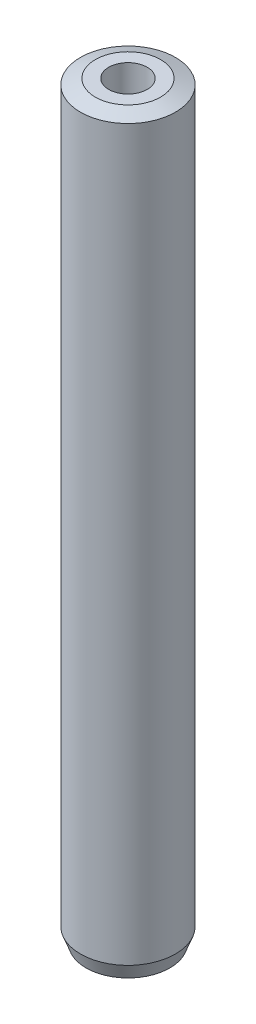
ISO-10303-21;
HEADER;
FILE_DESCRIPTION(('STEP AP214'),'2;1');
FILE_NAME('part.step','',(''),(''),'','','');
FILE_SCHEMA(('AUTOMOTIVE_DESIGN { 1 0 10303 214 1 1 1 1 }'));
ENDSEC;
DATA;
#1=APPLICATION_CONTEXT('core data for automotive mechanical design processes');
#2=APPLICATION_PROTOCOL_DEFINITION('international standard','automotive_design',2000,#1);
#3=PRODUCT_CONTEXT('',#1,'mechanical');
#4=PRODUCT('Part','Part','',(#3));
#5=PRODUCT_RELATED_PRODUCT_CATEGORY('part','',(#4));
#6=PRODUCT_DEFINITION_FORMATION('','',#4);
#7=PRODUCT_DEFINITION_CONTEXT('part definition',#1,'design');
#8=PRODUCT_DEFINITION('design','',#6,#7);
#9=PRODUCT_DEFINITION_SHAPE('','',#8);
#10=(LENGTH_UNIT() NAMED_UNIT(*) SI_UNIT(.MILLI.,.METRE.));
#11=(NAMED_UNIT(*) PLANE_ANGLE_UNIT() SI_UNIT($,.RADIAN.));
#12=(NAMED_UNIT(*) SI_UNIT($,.STERADIAN.) SOLID_ANGLE_UNIT());
#13=UNCERTAINTY_MEASURE_WITH_UNIT(LENGTH_MEASURE(1.E-05),#10,'distance_accuracy_value','');
#14=(GEOMETRIC_REPRESENTATION_CONTEXT(3) GLOBAL_UNCERTAINTY_ASSIGNED_CONTEXT((#13)) GLOBAL_UNIT_ASSIGNED_CONTEXT((#10,
#11,#12)) REPRESENTATION_CONTEXT('',''));
#15=CARTESIAN_POINT('',(0.,0.,0.));
#16=DIRECTION('',(0.,0.,1.));
#17=DIRECTION('',(1.,0.,0.));
#18=AXIS2_PLACEMENT_3D('',#15,#16,#17);
#19=CARTESIAN_POINT('',(0.,197.237292432304,0.));
#20=DIRECTION('',(0.,-1.,0.));
#21=DIRECTION('',(0.,0.,-1.));
#22=AXIS2_PLACEMENT_3D('',#19,#20,#21);
#23=CYLINDRICAL_SURFACE('',#22,12.5);
#24=CARTESIAN_POINT('',(0.,195.769966645253,0.));
#25=DIRECTION('',(0.,1.,0.));
#26=DIRECTION('',(0.,0.,1.));
#27=AXIS2_PLACEMENT_3D('',#24,#25,#26);
#28=CIRCLE('',#27,12.5);
#29=CARTESIAN_POINT('',(0.,195.769966645253,12.5));
#30=VERTEX_POINT('',#29);
#31=EDGE_CURVE('E50',#30,#30,#28,.F.);
#32=ORIENTED_EDGE('',*,*,#31,.T.);
#33=EDGE_LOOP('',(#32));
#34=FACE_BOUND('',#33,.T.);
#35=CARTESIAN_POINT('',(0.,3.92238217395144,0.));
#36=DIRECTION('',(0.,1.,0.));
#37=DIRECTION('',(0.,0.,1.));
#38=AXIS2_PLACEMENT_3D('',#35,#36,#37);
#39=CIRCLE('',#38,12.5);
#40=CARTESIAN_POINT('',(0.,3.92238217395144,12.5));
#41=VERTEX_POINT('',#40);
#42=EDGE_CURVE('E51',#41,#41,#39,.T.);
#43=ORIENTED_EDGE('',*,*,#42,.T.);
#44=EDGE_LOOP('',(#43));
#45=FACE_BOUND('',#44,.T.);
#46=ADVANCED_FACE('F39',(#34,#45),#23,.T.);
#47=CARTESIAN_POINT('',(0.,197.237292432304,0.));
#48=DIRECTION('',(0.,1.,0.));
#49=DIRECTION('',(0.,0.,1.));
#50=AXIS2_PLACEMENT_3D('',#47,#48,#49);
#51=PLANE('',#50);
#52=CARTESIAN_POINT('',(0.,197.237292432304,0.));
#53=DIRECTION('',(0.,1.,0.));
#54=DIRECTION('',(0.,0.,1.));
#55=AXIS2_PLACEMENT_3D('',#52,#53,#54);
#56=CIRCLE('',#55,8.57761782604866);
#57=CARTESIAN_POINT('',(0.,197.237292432304,8.57761782604866));
#58=VERTEX_POINT('',#57);
#59=EDGE_CURVE('E54',#58,#58,#56,.T.);
#60=ORIENTED_EDGE('',*,*,#59,.T.);
#61=EDGE_LOOP('',(#60));
#62=FACE_BOUND('',#61,.T.);
#63=CARTESIAN_POINT('',(0.,197.237292432304,0.));
#64=DIRECTION('',(0.,1.,0.));
#65=DIRECTION('',(0.,0.,1.));
#66=AXIS2_PLACEMENT_3D('',#63,#64,#65);
#67=CIRCLE('',#66,5.06899430948886);
#68=CARTESIAN_POINT('',(0.,197.237292432304,5.06899430948886));
#69=VERTEX_POINT('',#68);
#70=EDGE_CURVE('E58',#69,#69,#67,.T.);
#71=ORIENTED_EDGE('',*,*,#70,.F.);
#72=EDGE_LOOP('',(#71));
#73=FACE_BOUND('',#72,.T.);
#74=ADVANCED_FACE('F69',(#62,#73),#51,.T.);
#75=CARTESIAN_POINT('',(0.,0.,0.));
#76=DIRECTION('',(0.,1.,0.));
#77=DIRECTION('',(0.,0.,1.));
#78=AXIS2_PLACEMENT_3D('',#75,#76,#77);
#79=PLANE('',#78);
#80=CARTESIAN_POINT('',(0.,0.,0.));
#81=DIRECTION('',(0.,1.,0.));
#82=DIRECTION('',(0.,0.,1.));
#83=AXIS2_PLACEMENT_3D('',#80,#81,#82);
#84=CIRCLE('',#83,11.0326742129485);
#85=CARTESIAN_POINT('',(0.,0.,11.0326742129485));
#86=VERTEX_POINT('',#85);
#87=EDGE_CURVE('E10',#86,#86,#84,.F.);
#88=ORIENTED_EDGE('',*,*,#87,.T.);
#89=EDGE_LOOP('',(#88));
#90=FACE_BOUND('',#89,.T.);
#91=CARTESIAN_POINT('',(0.,0.,0.));
#92=DIRECTION('',(0.,1.,0.));
#93=DIRECTION('',(0.,0.,1.));
#94=AXIS2_PLACEMENT_3D('',#91,#92,#93);
#95=CIRCLE('',#94,5.06899430948886);
#96=CARTESIAN_POINT('',(0.,0.,5.06899430948886));
#97=VERTEX_POINT('',#96);
#98=EDGE_CURVE('E63',#97,#97,#95,.T.);
#99=ORIENTED_EDGE('',*,*,#98,.T.);
#100=EDGE_LOOP('',(#99));
#101=FACE_BOUND('',#100,.T.);
#102=ADVANCED_FACE('F75',(#90,#101),#79,.F.);
#103=CARTESIAN_POINT('',(0.,197.237292432304,0.));
#104=DIRECTION('',(0.,-1.,0.));
#105=DIRECTION('',(0.,0.,-1.));
#106=AXIS2_PLACEMENT_3D('',#103,#104,#105);
#107=CYLINDRICAL_SURFACE('',#106,5.06899430948886);
#108=ORIENTED_EDGE('',*,*,#70,.T.);
#109=EDGE_LOOP('',(#108));
#110=FACE_BOUND('',#109,.T.);
#111=ORIENTED_EDGE('',*,*,#98,.F.);
#112=EDGE_LOOP('',(#111));
#113=FACE_BOUND('',#112,.T.);
#114=ADVANCED_FACE('F70',(#110,#113),#107,.F.);
#115=CARTESIAN_POINT('',(0.,197.237292432304,0.));
#116=DIRECTION('',(0.,-1.,0.));
#117=DIRECTION('',(0.,0.,-1.));
#118=AXIS2_PLACEMENT_3D('',#115,#116,#117);
#119=CONICAL_SURFACE('',#118,8.57761782604866,1.21282329190818);
#120=ORIENTED_EDGE('',*,*,#31,.F.);
#121=EDGE_LOOP('',(#120));
#122=FACE_BOUND('',#121,.T.);
#123=ORIENTED_EDGE('',*,*,#59,.F.);
#124=EDGE_LOOP('',(#123));
#125=FACE_BOUND('',#124,.T.);
#126=ADVANCED_FACE('F81',(#122,#125),#119,.T.);
#127=CARTESIAN_POINT('',(0.,3.92238217395144,0.));
#128=DIRECTION('',(0.,1.,0.));
#129=DIRECTION('',(0.,0.,1.));
#130=AXIS2_PLACEMENT_3D('',#127,#128,#129);
#131=CONICAL_SURFACE('',#130,12.5,0.357973034886713);
#132=ORIENTED_EDGE('',*,*,#87,.F.);
#133=EDGE_LOOP('',(#132));
#134=FACE_BOUND('',#133,.T.);
#135=ORIENTED_EDGE('',*,*,#42,.F.);
#136=EDGE_LOOP('',(#135));
#137=FACE_BOUND('',#136,.T.);
#138=ADVANCED_FACE('F45',(#134,#137),#131,.T.);
#139=CLOSED_SHELL('',(#46,#74,#102,#114,#126,#138));
#140=MANIFOLD_SOLID_BREP('B2',#139);
#141=ADVANCED_BREP_SHAPE_REPRESENTATION('',(#18,#140),#14);
#142=SHAPE_DEFINITION_REPRESENTATION(#9,#141);
ENDSEC;
END-ISO-10303-21;
